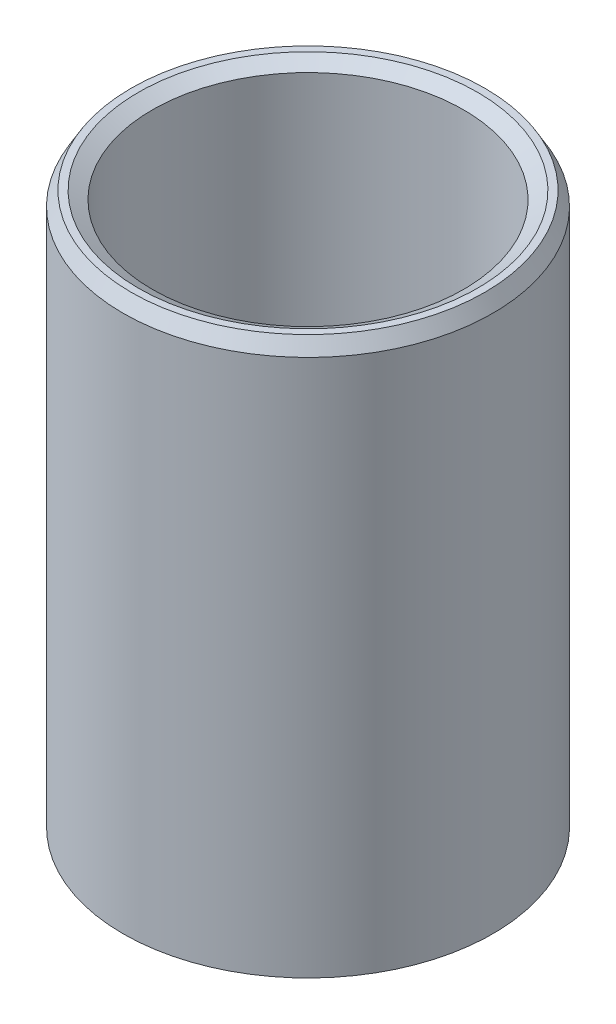
ISO-10303-21;
HEADER;
FILE_DESCRIPTION(('STEP AP214'),'2;1');
FILE_NAME('part.step','',(''),(''),'','','');
FILE_SCHEMA(('AUTOMOTIVE_DESIGN { 1 0 10303 214 1 1 1 1 }'));
ENDSEC;
DATA;
#1=APPLICATION_CONTEXT('core data for automotive mechanical design processes');
#2=APPLICATION_PROTOCOL_DEFINITION('international standard','automotive_design',2000,#1);
#3=PRODUCT_CONTEXT('',#1,'mechanical');
#4=PRODUCT('Part','Part','',(#3));
#5=PRODUCT_RELATED_PRODUCT_CATEGORY('part','',(#4));
#6=PRODUCT_DEFINITION_FORMATION('','',#4);
#7=PRODUCT_DEFINITION_CONTEXT('part definition',#1,'design');
#8=PRODUCT_DEFINITION('design','',#6,#7);
#9=PRODUCT_DEFINITION_SHAPE('','',#8);
#10=(LENGTH_UNIT() NAMED_UNIT(*) SI_UNIT(.MILLI.,.METRE.));
#11=(NAMED_UNIT(*) PLANE_ANGLE_UNIT() SI_UNIT($,.RADIAN.));
#12=(NAMED_UNIT(*) SI_UNIT($,.STERADIAN.) SOLID_ANGLE_UNIT());
#13=UNCERTAINTY_MEASURE_WITH_UNIT(LENGTH_MEASURE(1.E-05),#10,'distance_accuracy_value','');
#14=(GEOMETRIC_REPRESENTATION_CONTEXT(3) GLOBAL_UNCERTAINTY_ASSIGNED_CONTEXT((#13)) GLOBAL_UNIT_ASSIGNED_CONTEXT((#10,
#11,#12)) REPRESENTATION_CONTEXT('',''));
#15=CARTESIAN_POINT('',(0.,0.,0.));
#16=DIRECTION('',(0.,0.,1.));
#17=DIRECTION('',(1.,0.,0.));
#18=AXIS2_PLACEMENT_3D('',#15,#16,#17);
#19=CARTESIAN_POINT('',(0.,68.083866793931,0.));
#20=DIRECTION('',(0.,-1.,0.));
#21=DIRECTION('',(0.,0.,-1.));
#22=AXIS2_PLACEMENT_3D('',#19,#20,#21);
#23=CYLINDRICAL_SURFACE('',#22,22.5);
#24=CARTESIAN_POINT('',(0.,0.986417189193275,0.));
#25=DIRECTION('',(0.,1.,0.));
#26=DIRECTION('',(0.,0.,1.));
#27=AXIS2_PLACEMENT_3D('',#24,#25,#26);
#28=CIRCLE('',#27,22.5);
#29=CARTESIAN_POINT('',(0.,0.986417189193275,22.5));
#30=VERTEX_POINT('',#29);
#31=EDGE_CURVE('E10',#30,#30,#28,.T.);
#32=ORIENTED_EDGE('',*,*,#31,.T.);
#33=EDGE_LOOP('',(#32));
#34=FACE_BOUND('',#33,.T.);
#35=CARTESIAN_POINT('',(0.,66.375342104789,0.));
#36=DIRECTION('',(0.,1.,0.));
#37=DIRECTION('',(0.,0.,1.));
#38=AXIS2_PLACEMENT_3D('',#35,#36,#37);
#39=CIRCLE('',#38,22.5);
#40=CARTESIAN_POINT('',(0.,66.375342104789,22.5));
#41=VERTEX_POINT('',#40);
#42=EDGE_CURVE('E50',#41,#41,#39,.F.);
#43=ORIENTED_EDGE('',*,*,#42,.T.);
#44=EDGE_LOOP('',(#43));
#45=FACE_BOUND('',#44,.T.);
#46=ADVANCED_FACE('F39',(#34,#45),#23,.T.);
#47=CARTESIAN_POINT('',(0.,68.083866793931,0.));
#48=DIRECTION('',(0.,1.,0.));
#49=DIRECTION('',(0.,0.,1.));
#50=AXIS2_PLACEMENT_3D('',#47,#48,#49);
#51=PLANE('',#50);
#52=CARTESIAN_POINT('',(0.,68.083866793931,0.));
#53=DIRECTION('',(0.,1.,0.));
#54=DIRECTION('',(0.,0.,1.));
#55=AXIS2_PLACEMENT_3D('',#52,#53,#54);
#56=CIRCLE('',#55,20.6424215275499);
#57=CARTESIAN_POINT('',(0.,68.083866793931,20.6424215275499));
#58=VERTEX_POINT('',#57);
#59=EDGE_CURVE('E58',#58,#58,#56,.F.);
#60=ORIENTED_EDGE('',*,*,#59,.T.);
#61=EDGE_LOOP('',(#60));
#62=FACE_BOUND('',#61,.T.);
#63=CARTESIAN_POINT('',(0.,68.083866793931,0.));
#64=DIRECTION('',(0.,1.,0.));
#65=DIRECTION('',(0.,0.,1.));
#66=AXIS2_PLACEMENT_3D('',#63,#64,#65);
#67=CIRCLE('',#66,21.5135828108067);
#68=CARTESIAN_POINT('',(0.,68.083866793931,21.5135828108067));
#69=VERTEX_POINT('',#68);
#70=EDGE_CURVE('E61',#69,#69,#67,.T.);
#71=ORIENTED_EDGE('',*,*,#70,.T.);
#72=EDGE_LOOP('',(#71));
#73=FACE_BOUND('',#72,.T.);
#74=ADVANCED_FACE('F88',(#62,#73),#51,.T.);
#75=CARTESIAN_POINT('',(0.,0.,0.));
#76=DIRECTION('',(0.,1.,0.));
#77=DIRECTION('',(0.,0.,1.));
#78=AXIS2_PLACEMENT_3D('',#75,#76,#77);
#79=PLANE('',#78);
#80=CARTESIAN_POINT('',(0.,0.,0.));
#81=DIRECTION('',(0.,1.,0.));
#82=DIRECTION('',(0.,0.,1.));
#83=AXIS2_PLACEMENT_3D('',#80,#81,#82);
#84=CIRCLE('',#83,19.9203140276012);
#85=CARTESIAN_POINT('',(0.,0.,19.9203140276012));
#86=VERTEX_POINT('',#85);
#87=EDGE_CURVE('E51',#86,#86,#84,.T.);
#88=ORIENTED_EDGE('',*,*,#87,.T.);
#89=EDGE_LOOP('',(#88));
#90=FACE_BOUND('',#89,.T.);
#91=CARTESIAN_POINT('',(0.,0.,0.));
#92=DIRECTION('',(0.,1.,0.));
#93=DIRECTION('',(0.,0.,1.));
#94=AXIS2_PLACEMENT_3D('',#91,#92,#93);
#95=CIRCLE('',#94,20.791475310858);
#96=CARTESIAN_POINT('',(0.,0.,20.791475310858));
#97=VERTEX_POINT('',#96);
#98=EDGE_CURVE('E54',#97,#97,#95,.F.);
#99=ORIENTED_EDGE('',*,*,#98,.T.);
#100=EDGE_LOOP('',(#99));
#101=FACE_BOUND('',#100,.T.);
#102=ADVANCED_FACE('F83',(#90,#101),#79,.F.);
#103=CARTESIAN_POINT('',(0.,68.083866793931,0.));
#104=DIRECTION('',(0.,-1.,0.));
#105=DIRECTION('',(0.,0.,-1.));
#106=AXIS2_PLACEMENT_3D('',#103,#104,#105);
#107=CYLINDRICAL_SURFACE('',#106,18.9338968384079);
#108=CARTESIAN_POINT('',(0.,67.0974496047377,0.));
#109=DIRECTION('',(0.,1.,0.));
#110=DIRECTION('',(0.,0.,1.));
#111=AXIS2_PLACEMENT_3D('',#108,#109,#110);
#112=CIRCLE('',#111,18.9338968384079);
#113=CARTESIAN_POINT('',(0.,67.0974496047377,18.9338968384079));
#114=VERTEX_POINT('',#113);
#115=EDGE_CURVE('E67',#114,#114,#112,.T.);
#116=ORIENTED_EDGE('',*,*,#115,.T.);
#117=EDGE_LOOP('',(#116));
#118=FACE_BOUND('',#117,.T.);
#119=CARTESIAN_POINT('',(0.,1.70852468914205,0.));
#120=DIRECTION('',(0.,1.,0.));
#121=DIRECTION('',(0.,0.,1.));
#122=AXIS2_PLACEMENT_3D('',#119,#120,#121);
#123=CIRCLE('',#122,18.9338968384079);
#124=CARTESIAN_POINT('',(0.,1.70852468914205,18.9338968384079));
#125=VERTEX_POINT('',#124);
#126=EDGE_CURVE('E69',#125,#125,#123,.F.);
#127=ORIENTED_EDGE('',*,*,#126,.T.);
#128=EDGE_LOOP('',(#127));
#129=FACE_BOUND('',#128,.T.);
#130=ADVANCED_FACE('F71',(#118,#129),#107,.F.);
#131=CARTESIAN_POINT('',(0.,67.0974496047377,0.));
#132=DIRECTION('',(0.,1.,0.));
#133=DIRECTION('',(0.,0.,1.));
#134=AXIS2_PLACEMENT_3D('',#131,#132,#133);
#135=CONICAL_SURFACE('',#134,18.9338968384079,1.0471975511966);
#136=ORIENTED_EDGE('',*,*,#59,.F.);
#137=EDGE_LOOP('',(#136));
#138=FACE_BOUND('',#137,.T.);
#139=ORIENTED_EDGE('',*,*,#115,.F.);
#140=EDGE_LOOP('',(#139));
#141=FACE_BOUND('',#140,.T.);
#142=ADVANCED_FACE('F77',(#138,#141),#135,.F.);
#143=CARTESIAN_POINT('',(0.,0.,0.));
#144=DIRECTION('',(0.,-1.,0.));
#145=DIRECTION('',(0.,0.,-1.));
#146=AXIS2_PLACEMENT_3D('',#143,#144,#145);
#147=CONICAL_SURFACE('',#146,19.9203140276012,0.523598775598295);
#148=ORIENTED_EDGE('',*,*,#126,.F.);
#149=EDGE_LOOP('',(#148));
#150=FACE_BOUND('',#149,.T.);
#151=ORIENTED_EDGE('',*,*,#87,.F.);
#152=EDGE_LOOP('',(#151));
#153=FACE_BOUND('',#152,.T.);
#154=ADVANCED_FACE('F73',(#150,#153),#147,.F.);
#155=CARTESIAN_POINT('',(0.,0.986417189193275,0.));
#156=DIRECTION('',(0.,1.,0.));
#157=DIRECTION('',(0.,0.,1.));
#158=AXIS2_PLACEMENT_3D('',#155,#156,#157);
#159=CONICAL_SURFACE('',#158,22.5,1.0471975511966);
#160=ORIENTED_EDGE('',*,*,#98,.F.);
#161=EDGE_LOOP('',(#160));
#162=FACE_BOUND('',#161,.T.);
#163=ORIENTED_EDGE('',*,*,#31,.F.);
#164=EDGE_LOOP('',(#163));
#165=FACE_BOUND('',#164,.T.);
#166=ADVANCED_FACE('F76',(#162,#165),#159,.T.);
#167=CARTESIAN_POINT('',(0.,68.083866793931,0.));
#168=DIRECTION('',(0.,-1.,0.));
#169=DIRECTION('',(0.,0.,-1.));
#170=AXIS2_PLACEMENT_3D('',#167,#168,#169);
#171=CONICAL_SURFACE('',#170,21.5135828108067,0.523598775598296);
#172=ORIENTED_EDGE('',*,*,#42,.F.);
#173=EDGE_LOOP('',(#172));
#174=FACE_BOUND('',#173,.T.);
#175=ORIENTED_EDGE('',*,*,#70,.F.);
#176=EDGE_LOOP('',(#175));
#177=FACE_BOUND('',#176,.T.);
#178=ADVANCED_FACE('F45',(#174,#177),#171,.T.);
#179=CLOSED_SHELL('',(#46,#74,#102,#130,#142,#154,#166,#178));
#180=MANIFOLD_SOLID_BREP('B2',#179);
#181=ADVANCED_BREP_SHAPE_REPRESENTATION('',(#18,#180),#14);
#182=SHAPE_DEFINITION_REPRESENTATION(#9,#181);
ENDSEC;
END-ISO-10303-21;
